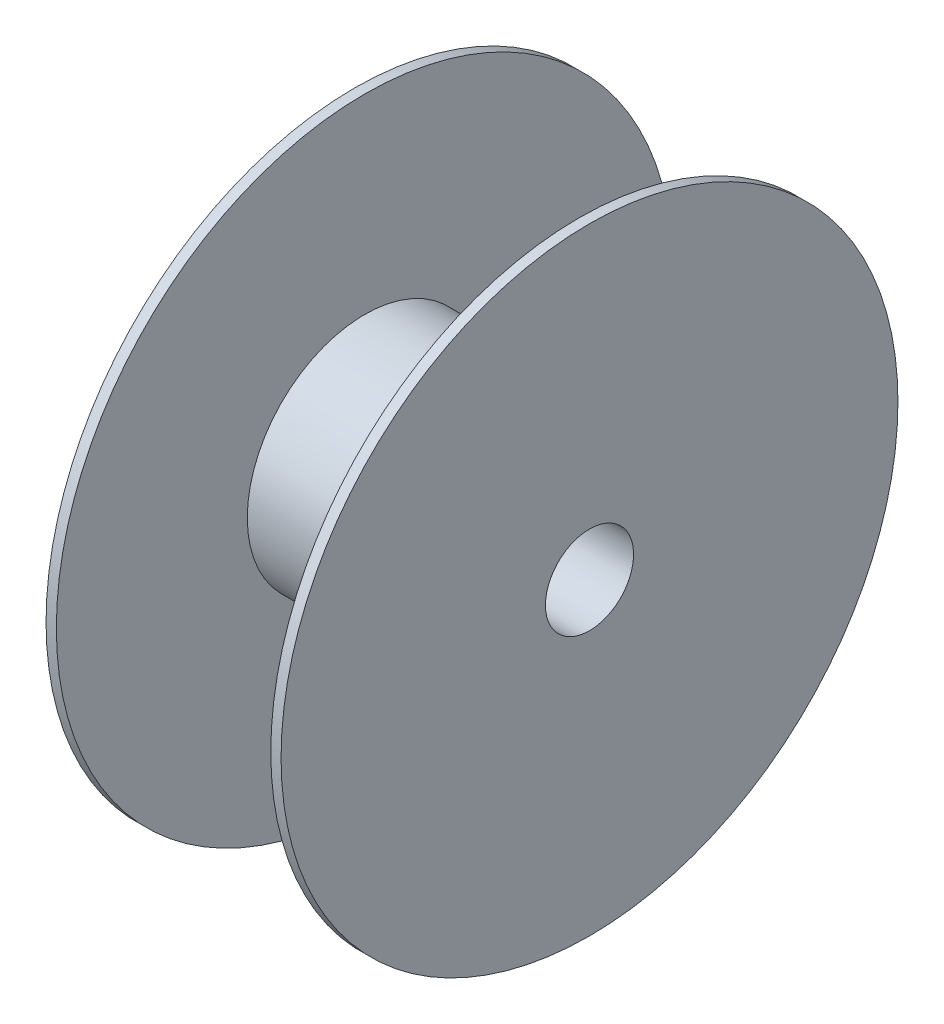
ISO-10303-21;
HEADER;
FILE_DESCRIPTION(('STEP AP214'),'2;1');
FILE_NAME('part.step','',(''),(''),'','','');
FILE_SCHEMA(('AUTOMOTIVE_DESIGN { 1 0 10303 214 1 1 1 1 }'));
ENDSEC;
DATA;
#1=APPLICATION_CONTEXT('core data for automotive mechanical design processes');
#2=APPLICATION_PROTOCOL_DEFINITION('international standard','automotive_design',2000,#1);
#3=PRODUCT_CONTEXT('',#1,'mechanical');
#4=PRODUCT('Part','Part','',(#3));
#5=PRODUCT_RELATED_PRODUCT_CATEGORY('part','',(#4));
#6=PRODUCT_DEFINITION_FORMATION('','',#4);
#7=PRODUCT_DEFINITION_CONTEXT('part definition',#1,'design');
#8=PRODUCT_DEFINITION('design','',#6,#7);
#9=PRODUCT_DEFINITION_SHAPE('','',#8);
#10=(LENGTH_UNIT() NAMED_UNIT(*) SI_UNIT(.MILLI.,.METRE.));
#11=(NAMED_UNIT(*) PLANE_ANGLE_UNIT() SI_UNIT($,.RADIAN.));
#12=(NAMED_UNIT(*) SI_UNIT($,.STERADIAN.) SOLID_ANGLE_UNIT());
#13=UNCERTAINTY_MEASURE_WITH_UNIT(LENGTH_MEASURE(1.E-05),#10,'distance_accuracy_value','');
#14=(GEOMETRIC_REPRESENTATION_CONTEXT(3) GLOBAL_UNCERTAINTY_ASSIGNED_CONTEXT((#13)) GLOBAL_UNIT_ASSIGNED_CONTEXT((#10,
#11,#12)) REPRESENTATION_CONTEXT('',''));
#15=CARTESIAN_POINT('',(0.,0.,0.));
#16=DIRECTION('',(0.,0.,1.));
#17=DIRECTION('',(1.,0.,0.));
#18=AXIS2_PLACEMENT_3D('',#15,#16,#17);
#19=CARTESIAN_POINT('',(101.6,133.35,0.));
#20=DIRECTION('',(-1.,0.,0.));
#21=DIRECTION('',(0.,0.,1.));
#22=AXIS2_PLACEMENT_3D('',#19,#20,#21);
#23=PLANE('',#22);
#24=CARTESIAN_POINT('',(101.6,0.,0.));
#25=DIRECTION('',(-1.,0.,0.));
#26=DIRECTION('',(0.,0.,1.));
#27=AXIS2_PLACEMENT_3D('',#24,#25,#26);
#28=CIRCLE('',#27,133.35);
#29=CARTESIAN_POINT('',(101.6,0.,133.35));
#30=VERTEX_POINT('',#29);
#31=EDGE_CURVE('E58',#30,#30,#28,.T.);
#32=ORIENTED_EDGE('',*,*,#31,.F.);
#33=EDGE_LOOP('',(#32));
#34=FACE_BOUND('',#33,.T.);
#35=CARTESIAN_POINT('',(101.6,0.,0.));
#36=DIRECTION('',(-1.,0.,0.));
#37=DIRECTION('',(0.,0.,1.));
#38=AXIS2_PLACEMENT_3D('',#35,#36,#37);
#39=CIRCLE('',#38,19.05);
#40=CARTESIAN_POINT('',(101.6,0.,19.05));
#41=VERTEX_POINT('',#40);
#42=EDGE_CURVE('E10',#41,#41,#39,.T.);
#43=ORIENTED_EDGE('',*,*,#42,.T.);
#44=EDGE_LOOP('',(#43));
#45=FACE_BOUND('',#44,.T.);
#46=ADVANCED_FACE('F30',(#34,#45),#23,.F.);
#47=CARTESIAN_POINT('',(0.,0.,0.));
#48=DIRECTION('',(-1.,0.,0.));
#49=DIRECTION('',(0.,0.,1.));
#50=AXIS2_PLACEMENT_3D('',#47,#48,#49);
#51=CYLINDRICAL_SURFACE('',#50,19.05);
#52=ORIENTED_EDGE('',*,*,#42,.F.);
#53=EDGE_LOOP('',(#52));
#54=FACE_BOUND('',#53,.T.);
#55=CARTESIAN_POINT('',(0.,0.,0.));
#56=DIRECTION('',(-1.,0.,0.));
#57=DIRECTION('',(0.,0.,1.));
#58=AXIS2_PLACEMENT_3D('',#55,#56,#57);
#59=CIRCLE('',#58,19.05);
#60=CARTESIAN_POINT('',(0.,0.,19.05));
#61=VERTEX_POINT('',#60);
#62=EDGE_CURVE('E36',#61,#61,#59,.T.);
#63=ORIENTED_EDGE('',*,*,#62,.T.);
#64=EDGE_LOOP('',(#63));
#65=FACE_BOUND('',#64,.T.);
#66=ADVANCED_FACE('F65',(#54,#65),#51,.F.);
#67=CARTESIAN_POINT('',(0.,19.05,0.));
#68=DIRECTION('',(1.,0.,0.));
#69=DIRECTION('',(0.,0.,-1.));
#70=AXIS2_PLACEMENT_3D('',#67,#68,#69);
#71=PLANE('',#70);
#72=ORIENTED_EDGE('',*,*,#62,.F.);
#73=EDGE_LOOP('',(#72));
#74=FACE_BOUND('',#73,.T.);
#75=CARTESIAN_POINT('',(0.,0.,0.));
#76=DIRECTION('',(-1.,0.,0.));
#77=DIRECTION('',(0.,0.,1.));
#78=AXIS2_PLACEMENT_3D('',#75,#76,#77);
#79=CIRCLE('',#78,133.35);
#80=CARTESIAN_POINT('',(0.,0.,133.35));
#81=VERTEX_POINT('',#80);
#82=EDGE_CURVE('E40',#81,#81,#79,.T.);
#83=ORIENTED_EDGE('',*,*,#82,.T.);
#84=EDGE_LOOP('',(#83));
#85=FACE_BOUND('',#84,.T.);
#86=ADVANCED_FACE('F69',(#74,#85),#71,.F.);
#87=CARTESIAN_POINT('',(0.,0.,0.));
#88=DIRECTION('',(-1.,0.,0.));
#89=DIRECTION('',(0.,0.,1.));
#90=AXIS2_PLACEMENT_3D('',#87,#88,#89);
#91=CYLINDRICAL_SURFACE('',#90,133.35);
#92=ORIENTED_EDGE('',*,*,#82,.F.);
#93=EDGE_LOOP('',(#92));
#94=FACE_BOUND('',#93,.T.);
#95=CARTESIAN_POINT('',(4.445,0.,0.));
#96=DIRECTION('',(-1.,0.,0.));
#97=DIRECTION('',(0.,0.,1.));
#98=AXIS2_PLACEMENT_3D('',#95,#96,#97);
#99=CIRCLE('',#98,133.35);
#100=CARTESIAN_POINT('',(4.445,0.,133.35));
#101=VERTEX_POINT('',#100);
#102=EDGE_CURVE('E44',#101,#101,#99,.T.);
#103=ORIENTED_EDGE('',*,*,#102,.T.);
#104=EDGE_LOOP('',(#103));
#105=FACE_BOUND('',#104,.T.);
#106=ADVANCED_FACE('F74',(#94,#105),#91,.T.);
#107=CARTESIAN_POINT('',(4.445,133.35,0.));
#108=DIRECTION('',(-1.,0.,0.));
#109=DIRECTION('',(0.,0.,1.));
#110=AXIS2_PLACEMENT_3D('',#107,#108,#109);
#111=PLANE('',#110);
#112=ORIENTED_EDGE('',*,*,#102,.F.);
#113=EDGE_LOOP('',(#112));
#114=FACE_BOUND('',#113,.T.);
#115=CARTESIAN_POINT('',(4.44500000000001,0.,0.));
#116=DIRECTION('',(-1.,0.,0.));
#117=DIRECTION('',(0.,0.,1.));
#118=AXIS2_PLACEMENT_3D('',#115,#116,#117);
#119=CIRCLE('',#118,50.8);
#120=CARTESIAN_POINT('',(4.44500000000001,0.,50.8));
#121=VERTEX_POINT('',#120);
#122=EDGE_CURVE('E49',#121,#121,#119,.T.);
#123=ORIENTED_EDGE('',*,*,#122,.T.);
#124=EDGE_LOOP('',(#123));
#125=FACE_BOUND('',#124,.T.);
#126=ADVANCED_FACE('F80',(#114,#125),#111,.F.);
#127=CARTESIAN_POINT('',(0.,0.,0.));
#128=DIRECTION('',(-1.,0.,0.));
#129=DIRECTION('',(0.,0.,1.));
#130=AXIS2_PLACEMENT_3D('',#127,#128,#129);
#131=CYLINDRICAL_SURFACE('',#130,50.8);
#132=ORIENTED_EDGE('',*,*,#122,.F.);
#133=EDGE_LOOP('',(#132));
#134=FACE_BOUND('',#133,.T.);
#135=CARTESIAN_POINT('',(97.155,0.,0.));
#136=DIRECTION('',(-1.,0.,0.));
#137=DIRECTION('',(0.,0.,1.));
#138=AXIS2_PLACEMENT_3D('',#135,#136,#137);
#139=CIRCLE('',#138,50.8);
#140=CARTESIAN_POINT('',(97.155,0.,50.8));
#141=VERTEX_POINT('',#140);
#142=EDGE_CURVE('E52',#141,#141,#139,.T.);
#143=ORIENTED_EDGE('',*,*,#142,.T.);
#144=EDGE_LOOP('',(#143));
#145=FACE_BOUND('',#144,.T.);
#146=ADVANCED_FACE('F84',(#134,#145),#131,.T.);
#147=CARTESIAN_POINT('',(97.155,50.8,0.));
#148=DIRECTION('',(1.,0.,0.));
#149=DIRECTION('',(0.,0.,-1.));
#150=AXIS2_PLACEMENT_3D('',#147,#148,#149);
#151=PLANE('',#150);
#152=ORIENTED_EDGE('',*,*,#142,.F.);
#153=EDGE_LOOP('',(#152));
#154=FACE_BOUND('',#153,.T.);
#155=CARTESIAN_POINT('',(97.155,0.,0.));
#156=DIRECTION('',(-1.,0.,0.));
#157=DIRECTION('',(0.,0.,1.));
#158=AXIS2_PLACEMENT_3D('',#155,#156,#157);
#159=CIRCLE('',#158,133.35);
#160=CARTESIAN_POINT('',(97.155,0.,133.35));
#161=VERTEX_POINT('',#160);
#162=EDGE_CURVE('E55',#161,#161,#159,.T.);
#163=ORIENTED_EDGE('',*,*,#162,.T.);
#164=EDGE_LOOP('',(#163));
#165=FACE_BOUND('',#164,.T.);
#166=ADVANCED_FACE('F88',(#154,#165),#151,.F.);
#167=CARTESIAN_POINT('',(0.,0.,0.));
#168=DIRECTION('',(-1.,0.,0.));
#169=DIRECTION('',(0.,0.,1.));
#170=AXIS2_PLACEMENT_3D('',#167,#168,#169);
#171=CYLINDRICAL_SURFACE('',#170,133.35);
#172=ORIENTED_EDGE('',*,*,#162,.F.);
#173=EDGE_LOOP('',(#172));
#174=FACE_BOUND('',#173,.T.);
#175=ORIENTED_EDGE('',*,*,#31,.T.);
#176=EDGE_LOOP('',(#175));
#177=FACE_BOUND('',#176,.T.);
#178=ADVANCED_FACE('F62',(#174,#177),#171,.T.);
#179=CLOSED_SHELL('',(#46,#66,#86,#106,#126,#146,#166,#178));
#180=MANIFOLD_SOLID_BREP('B2',#179);
#181=ADVANCED_BREP_SHAPE_REPRESENTATION('',(#18,#180),#14);
#182=SHAPE_DEFINITION_REPRESENTATION(#9,#181);
ENDSEC;
END-ISO-10303-21;
